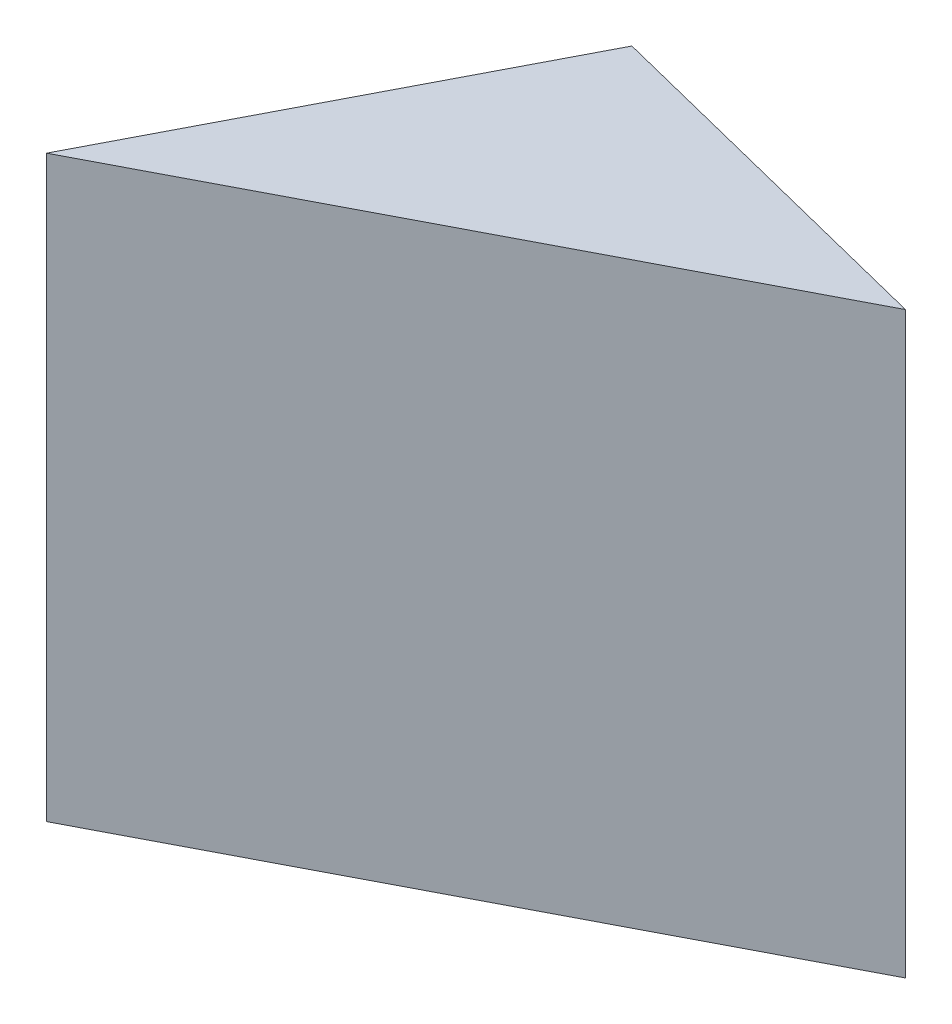
ISO-10303-21;
HEADER;
FILE_DESCRIPTION(('STEP AP214'),'2;1');
FILE_NAME('part.step','',(''),(''),'','','');
FILE_SCHEMA(('AUTOMOTIVE_DESIGN { 1 0 10303 214 1 1 1 1 }'));
ENDSEC;
DATA;
#1=APPLICATION_CONTEXT('core data for automotive mechanical design processes');
#2=APPLICATION_PROTOCOL_DEFINITION('international standard','automotive_design',2000,#1);
#3=PRODUCT_CONTEXT('',#1,'mechanical');
#4=PRODUCT('Part','Part','',(#3));
#5=PRODUCT_RELATED_PRODUCT_CATEGORY('part','',(#4));
#6=PRODUCT_DEFINITION_FORMATION('','',#4);
#7=PRODUCT_DEFINITION_CONTEXT('part definition',#1,'design');
#8=PRODUCT_DEFINITION('design','',#6,#7);
#9=PRODUCT_DEFINITION_SHAPE('','',#8);
#10=(LENGTH_UNIT() NAMED_UNIT(*) SI_UNIT(.MILLI.,.METRE.));
#11=(NAMED_UNIT(*) PLANE_ANGLE_UNIT() SI_UNIT($,.RADIAN.));
#12=(NAMED_UNIT(*) SI_UNIT($,.STERADIAN.) SOLID_ANGLE_UNIT());
#13=UNCERTAINTY_MEASURE_WITH_UNIT(LENGTH_MEASURE(1.E-05),#10,'distance_accuracy_value','');
#14=(GEOMETRIC_REPRESENTATION_CONTEXT(3) GLOBAL_UNCERTAINTY_ASSIGNED_CONTEXT((#13)) GLOBAL_UNIT_ASSIGNED_CONTEXT((#10,
#11,#12)) REPRESENTATION_CONTEXT('',''));
#15=CARTESIAN_POINT('',(0.,0.,0.));
#16=DIRECTION('',(0.,0.,1.));
#17=DIRECTION('',(1.,0.,0.));
#18=AXIS2_PLACEMENT_3D('',#15,#16,#17);
#19=CARTESIAN_POINT('',(19.5149073366954,20.,-10.1571842377793));
#20=DIRECTION('',(-0.46169019262633,0.,-0.887041242577064));
#21=DIRECTION('',(-0.887041242577064,0.,0.46169019262633));
#22=AXIS2_PLACEMENT_3D('',#19,#20,#21);
#23=PLANE('',#22);
#24=DIRECTION('',(0.887041242577064,0.,-0.46169019262633));
#25=VECTOR('',#24,1.);
#26=CARTESIAN_POINT('',(19.5149073366954,0.,-10.1571842377793));
#27=LINE('',#26,#25);
#28=CARTESIAN_POINT('',(0.,0.,0.));
#29=VERTEX_POINT('',#28);
#30=CARTESIAN_POINT('',(19.5149073366954,0.,-10.1571842377793));
#31=VERTEX_POINT('',#30);
#32=EDGE_CURVE('E66',#29,#31,#27,.T.);
#33=ORIENTED_EDGE('',*,*,#32,.T.);
#34=DIRECTION('',(0.,-1.,0.));
#35=VECTOR('',#34,1.);
#36=CARTESIAN_POINT('',(19.5149073366954,20.,-10.1571842377793));
#37=LINE('',#36,#35);
#38=CARTESIAN_POINT('',(19.5149073366954,20.,-10.1571842377793));
#39=VERTEX_POINT('',#38);
#40=EDGE_CURVE('E11',#39,#31,#37,.T.);
#41=ORIENTED_EDGE('',*,*,#40,.F.);
#42=DIRECTION('',(0.887041242577064,0.,-0.46169019262633));
#43=VECTOR('',#42,1.);
#44=CARTESIAN_POINT('',(19.5149073366954,20.,-10.1571842377793));
#45=LINE('',#44,#43);
#46=CARTESIAN_POINT('',(0.,20.,0.));
#47=VERTEX_POINT('',#46);
#48=EDGE_CURVE('E80',#47,#39,#45,.T.);
#49=ORIENTED_EDGE('',*,*,#48,.F.);
#50=DIRECTION('',(0.,-1.,0.));
#51=VECTOR('',#50,1.);
#52=CARTESIAN_POINT('',(0.,20.,0.));
#53=LINE('',#52,#51);
#54=EDGE_CURVE('E76',#47,#29,#53,.T.);
#55=ORIENTED_EDGE('',*,*,#54,.T.);
#56=EDGE_LOOP('',(#33,#41,#49,#55));
#57=FACE_BOUND('',#56,.T.);
#58=ADVANCED_FACE('F30',(#57),#23,.F.);
#59=CARTESIAN_POINT('',(6.90461729873375,20.,-13.3163906505489));
#60=DIRECTION('',(-0.243015877905358,0.,0.970022310612435));
#61=DIRECTION('',(0.970022310612435,0.,0.243015877905358));
#62=AXIS2_PLACEMENT_3D('',#59,#60,#61);
#63=PLANE('',#62);
#64=DIRECTION('',(-0.970022310612435,0.,-0.243015877905358));
#65=VECTOR('',#64,1.);
#66=CARTESIAN_POINT('',(6.90461729873375,0.,-13.3163906505489));
#67=LINE('',#66,#65);
#68=CARTESIAN_POINT('',(6.90461729873375,0.,-13.3163906505489));
#69=VERTEX_POINT('',#68);
#70=EDGE_CURVE('E63',#31,#69,#67,.T.);
#71=ORIENTED_EDGE('',*,*,#70,.T.);
#72=DIRECTION('',(0.,-1.,0.));
#73=VECTOR('',#72,1.);
#74=CARTESIAN_POINT('',(6.90461729873375,20.,-13.3163906505489));
#75=LINE('',#74,#73);
#76=CARTESIAN_POINT('',(6.90461729873375,20.,-13.3163906505489));
#77=VERTEX_POINT('',#76);
#78=EDGE_CURVE('E37',#77,#69,#75,.T.);
#79=ORIENTED_EDGE('',*,*,#78,.F.);
#80=DIRECTION('',(-0.970022310612435,0.,-0.243015877905358));
#81=VECTOR('',#80,1.);
#82=CARTESIAN_POINT('',(6.90461729873375,20.,-13.3163906505489));
#83=LINE('',#82,#81);
#84=EDGE_CURVE('E48',#39,#77,#83,.T.);
#85=ORIENTED_EDGE('',*,*,#84,.F.);
#86=ORIENTED_EDGE('',*,*,#40,.T.);
#87=EDGE_LOOP('',(#71,#79,#85,#86));
#88=FACE_BOUND('',#87,.T.);
#89=ADVANCED_FACE('F72',(#88),#63,.F.);
#90=CARTESIAN_POINT('',(0.,20.,0.));
#91=DIRECTION('',(0.887759376703261,0.,0.460307819915584));
#92=DIRECTION('',(0.460307819915584,0.,-0.887759376703261));
#93=AXIS2_PLACEMENT_3D('',#90,#91,#92);
#94=PLANE('',#93);
#95=DIRECTION('',(-0.460307819915583,0.,0.887759376703261));
#96=VECTOR('',#95,1.);
#97=CARTESIAN_POINT('',(0.,0.,0.));
#98=LINE('',#97,#96);
#99=EDGE_CURVE('E67',#69,#29,#98,.T.);
#100=ORIENTED_EDGE('',*,*,#99,.T.);
#101=ORIENTED_EDGE('',*,*,#54,.F.);
#102=DIRECTION('',(-0.460307819915583,0.,0.887759376703261));
#103=VECTOR('',#102,1.);
#104=CARTESIAN_POINT('',(0.,20.,0.));
#105=LINE('',#104,#103);
#106=EDGE_CURVE('E44',#77,#47,#105,.T.);
#107=ORIENTED_EDGE('',*,*,#106,.F.);
#108=ORIENTED_EDGE('',*,*,#78,.T.);
#109=EDGE_LOOP('',(#100,#101,#107,#108));
#110=FACE_BOUND('',#109,.T.);
#111=ADVANCED_FACE('F85',(#110),#94,.F.);
#112=CARTESIAN_POINT('',(19.5149073366954,20.,-10.1571842377793));
#113=DIRECTION('',(0.,1.,0.));
#114=DIRECTION('',(0.,0.,1.));
#115=AXIS2_PLACEMENT_3D('',#112,#113,#114);
#116=PLANE('',#115);
#117=ORIENTED_EDGE('',*,*,#48,.T.);
#118=ORIENTED_EDGE('',*,*,#84,.T.);
#119=ORIENTED_EDGE('',*,*,#106,.T.);
#120=EDGE_LOOP('',(#117,#118,#119));
#121=FACE_BOUND('',#120,.T.);
#122=ADVANCED_FACE('F86',(#121),#116,.T.);
#123=CARTESIAN_POINT('',(19.5149073366954,0.,-10.1571842377793));
#124=DIRECTION('',(0.,1.,0.));
#125=DIRECTION('',(0.,0.,1.));
#126=AXIS2_PLACEMENT_3D('',#123,#124,#125);
#127=PLANE('',#126);
#128=ORIENTED_EDGE('',*,*,#32,.F.);
#129=ORIENTED_EDGE('',*,*,#99,.F.);
#130=ORIENTED_EDGE('',*,*,#70,.F.);
#131=EDGE_LOOP('',(#128,#129,#130));
#132=FACE_BOUND('',#131,.T.);
#133=ADVANCED_FACE('F64',(#132),#127,.F.);
#134=CLOSED_SHELL('',(#58,#89,#111,#122,#133));
#135=MANIFOLD_SOLID_BREP('B2',#134);
#136=ADVANCED_BREP_SHAPE_REPRESENTATION('',(#18,#135),#14);
#137=SHAPE_DEFINITION_REPRESENTATION(#9,#136);
ENDSEC;
END-ISO-10303-21;
